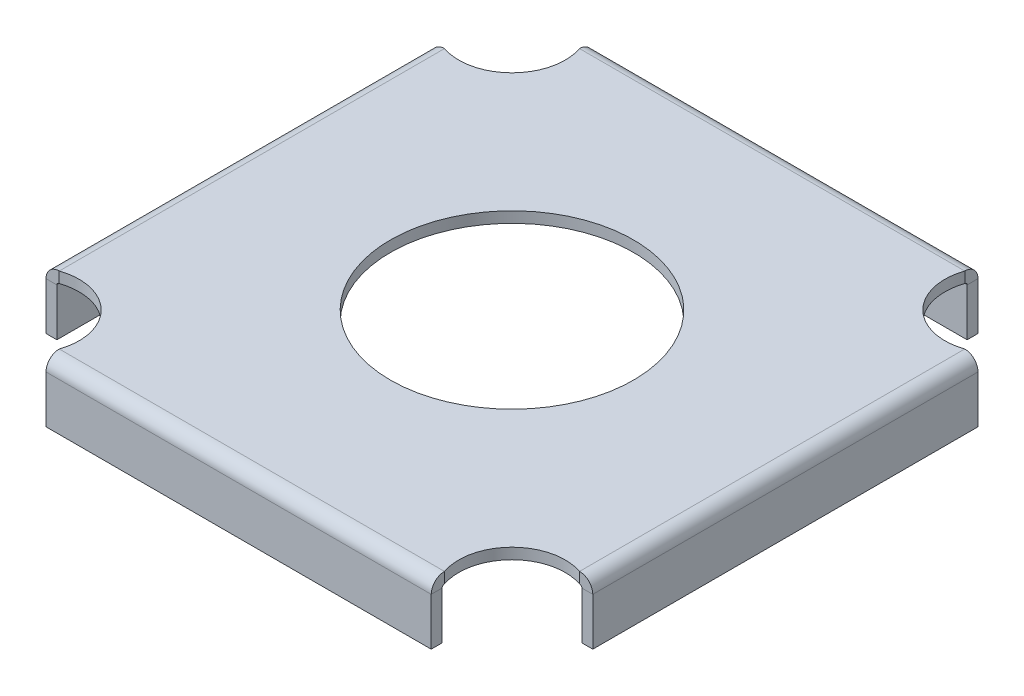
ISO-10303-21;
HEADER;
FILE_DESCRIPTION(('STEP AP214'),'2;1');
FILE_NAME('part.step','',(''),(''),'','','');
FILE_SCHEMA(('AUTOMOTIVE_DESIGN { 1 0 10303 214 1 1 1 1 }'));
ENDSEC;
DATA;
#1=APPLICATION_CONTEXT('core data for automotive mechanical design processes');
#2=APPLICATION_PROTOCOL_DEFINITION('international standard','automotive_design',2000,#1);
#3=PRODUCT_CONTEXT('',#1,'mechanical');
#4=PRODUCT('Part','Part','',(#3));
#5=PRODUCT_RELATED_PRODUCT_CATEGORY('part','',(#4));
#6=PRODUCT_DEFINITION_FORMATION('','',#4);
#7=PRODUCT_DEFINITION_CONTEXT('part definition',#1,'design');
#8=PRODUCT_DEFINITION('design','',#6,#7);
#9=PRODUCT_DEFINITION_SHAPE('','',#8);
#10=(LENGTH_UNIT() NAMED_UNIT(*) SI_UNIT(.MILLI.,.METRE.));
#11=(NAMED_UNIT(*) PLANE_ANGLE_UNIT() SI_UNIT($,.RADIAN.));
#12=(NAMED_UNIT(*) SI_UNIT($,.STERADIAN.) SOLID_ANGLE_UNIT());
#13=UNCERTAINTY_MEASURE_WITH_UNIT(LENGTH_MEASURE(1.E-05),#10,'distance_accuracy_value','');
#14=(GEOMETRIC_REPRESENTATION_CONTEXT(3) GLOBAL_UNCERTAINTY_ASSIGNED_CONTEXT((#13)) GLOBAL_UNIT_ASSIGNED_CONTEXT((#10,
#11,#12)) REPRESENTATION_CONTEXT('',''));
#15=CARTESIAN_POINT('',(0.,0.,0.));
#16=DIRECTION('',(0.,0.,1.));
#17=DIRECTION('',(1.,0.,0.));
#18=AXIS2_PLACEMENT_3D('',#15,#16,#17);
#19=CARTESIAN_POINT('',(76.2,-3.4163,76.2));
#20=DIRECTION('',(0.,1.,0.));
#21=DIRECTION('',(0.,0.,1.));
#22=AXIS2_PLACEMENT_3D('',#19,#20,#21);
#23=CYLINDRICAL_SURFACE('',#22,16.7005);
#24=CARTESIAN_POINT('',(76.2,0.,76.2));
#25=DIRECTION('',(0.,-1.,0.));
#26=DIRECTION('',(0.,0.,1.));
#27=AXIS2_PLACEMENT_3D('',#24,#25,#26);
#28=CIRCLE('',#27,16.7005);
#29=CARTESIAN_POINT('',(60.3828089759907,0.,81.5594));
#30=VERTEX_POINT('',#29);
#31=CARTESIAN_POINT('',(81.5594,0.,60.3828089759907));
#32=VERTEX_POINT('',#31);
#33=EDGE_CURVE('E464',#30,#32,#28,.T.);
#34=ORIENTED_EDGE('',*,*,#33,.F.);
#35=DIRECTION('',(0.,1.,0.));
#36=VECTOR('',#35,1.);
#37=CARTESIAN_POINT('',(60.3828089759907,-3.4163,81.5594));
#38=LINE('',#37,#36);
#39=CARTESIAN_POINT('',(60.3828089759907,-3.41629999999999,81.5594));
#40=VERTEX_POINT('',#39);
#41=EDGE_CURVE('E13',#40,#30,#38,.T.);
#42=ORIENTED_EDGE('',*,*,#41,.F.);
#43=CARTESIAN_POINT('',(76.2,-3.4163,76.2));
#44=DIRECTION('',(0.,-1.,0.));
#45=DIRECTION('',(0.,0.,1.));
#46=AXIS2_PLACEMENT_3D('',#43,#44,#45);
#47=CIRCLE('',#46,16.7005);
#48=CARTESIAN_POINT('',(81.5594,-3.4163,60.3828089759907));
#49=VERTEX_POINT('',#48);
#50=EDGE_CURVE('E467',#40,#49,#47,.T.);
#51=ORIENTED_EDGE('',*,*,#50,.T.);
#52=DIRECTION('',(0.,1.,0.));
#53=VECTOR('',#52,1.);
#54=CARTESIAN_POINT('',(81.5594,-3.4163,60.3828089759907));
#55=LINE('',#54,#53);
#56=EDGE_CURVE('E121',#49,#32,#55,.T.);
#57=ORIENTED_EDGE('',*,*,#56,.T.);
#58=EDGE_LOOP('',(#34,#42,#51,#57));
#59=FACE_BOUND('',#58,.T.);
#60=ADVANCED_FACE('F118',(#59),#23,.F.);
#61=CARTESIAN_POINT('',(-76.2,-3.4163,76.2));
#62=DIRECTION('',(0.,1.,0.));
#63=DIRECTION('',(0.,0.,1.));
#64=AXIS2_PLACEMENT_3D('',#61,#62,#63);
#65=CYLINDRICAL_SURFACE('',#64,16.7005);
#66=CARTESIAN_POINT('',(-76.2,0.,76.2));
#67=DIRECTION('',(0.,-1.,0.));
#68=DIRECTION('',(0.,0.,1.));
#69=AXIS2_PLACEMENT_3D('',#66,#67,#68);
#70=CIRCLE('',#69,16.7005);
#71=CARTESIAN_POINT('',(-81.5594,0.,60.3828089759907));
#72=VERTEX_POINT('',#71);
#73=CARTESIAN_POINT('',(-60.3828089759907,0.,81.5594));
#74=VERTEX_POINT('',#73);
#75=EDGE_CURVE('E505',#72,#74,#70,.T.);
#76=ORIENTED_EDGE('',*,*,#75,.F.);
#77=DIRECTION('',(0.,1.,0.));
#78=VECTOR('',#77,1.);
#79=CARTESIAN_POINT('',(-81.5594,-3.4163,60.3828089759907));
#80=LINE('',#79,#78);
#81=CARTESIAN_POINT('',(-81.5594,-3.4163,60.3828089759907));
#82=VERTEX_POINT('',#81);
#83=EDGE_CURVE('E512',#82,#72,#80,.T.);
#84=ORIENTED_EDGE('',*,*,#83,.F.);
#85=CARTESIAN_POINT('',(-76.2,-3.4163,76.2));
#86=DIRECTION('',(0.,-1.,0.));
#87=DIRECTION('',(0.,0.,1.));
#88=AXIS2_PLACEMENT_3D('',#85,#86,#87);
#89=CIRCLE('',#88,16.7005);
#90=CARTESIAN_POINT('',(-60.3828089759907,-3.41629999999999,81.5594));
#91=VERTEX_POINT('',#90);
#92=EDGE_CURVE('E483',#82,#91,#89,.T.);
#93=ORIENTED_EDGE('',*,*,#92,.T.);
#94=DIRECTION('',(0.,1.,0.));
#95=VECTOR('',#94,1.);
#96=CARTESIAN_POINT('',(-60.3828089759907,-3.4163,81.5594));
#97=LINE('',#96,#95);
#98=EDGE_CURVE('E126',#91,#74,#97,.T.);
#99=ORIENTED_EDGE('',*,*,#98,.T.);
#100=EDGE_LOOP('',(#76,#84,#93,#99));
#101=FACE_BOUND('',#100,.T.);
#102=ADVANCED_FACE('F544',(#101),#65,.F.);
#103=CARTESIAN_POINT('',(-76.2,-3.4163,-76.2));
#104=DIRECTION('',(0.,1.,0.));
#105=DIRECTION('',(0.,0.,1.));
#106=AXIS2_PLACEMENT_3D('',#103,#104,#105);
#107=CYLINDRICAL_SURFACE('',#106,16.7005);
#108=CARTESIAN_POINT('',(-76.2,0.,-76.2));
#109=DIRECTION('',(0.,-1.,0.));
#110=DIRECTION('',(0.,0.,1.));
#111=AXIS2_PLACEMENT_3D('',#108,#109,#110);
#112=CIRCLE('',#111,16.7005);
#113=CARTESIAN_POINT('',(-60.3828089759907,0.,-81.5594));
#114=VERTEX_POINT('',#113);
#115=CARTESIAN_POINT('',(-81.5594,0.,-60.3828089759907));
#116=VERTEX_POINT('',#115);
#117=EDGE_CURVE('E499',#114,#116,#112,.T.);
#118=ORIENTED_EDGE('',*,*,#117,.F.);
#119=DIRECTION('',(0.,1.,0.));
#120=VECTOR('',#119,1.);
#121=CARTESIAN_POINT('',(-60.3828089759907,-3.4163,-81.5594));
#122=LINE('',#121,#120);
#123=CARTESIAN_POINT('',(-60.3828089759907,-3.4163,-81.5594));
#124=VERTEX_POINT('',#123);
#125=EDGE_CURVE('E517',#124,#114,#122,.T.);
#126=ORIENTED_EDGE('',*,*,#125,.F.);
#127=CARTESIAN_POINT('',(-76.2,-3.4163,-76.2));
#128=DIRECTION('',(0.,-1.,0.));
#129=DIRECTION('',(0.,0.,1.));
#130=AXIS2_PLACEMENT_3D('',#127,#128,#129);
#131=CIRCLE('',#130,16.7005);
#132=CARTESIAN_POINT('',(-81.5594,-3.4163,-60.3828089759907));
#133=VERTEX_POINT('',#132);
#134=EDGE_CURVE('E478',#124,#133,#131,.T.);
#135=ORIENTED_EDGE('',*,*,#134,.T.);
#136=DIRECTION('',(0.,1.,0.));
#137=VECTOR('',#136,1.);
#138=CARTESIAN_POINT('',(-81.5594,-3.4163,-60.3828089759907));
#139=LINE('',#138,#137);
#140=EDGE_CURVE('E514',#133,#116,#139,.T.);
#141=ORIENTED_EDGE('',*,*,#140,.T.);
#142=EDGE_LOOP('',(#118,#126,#135,#141));
#143=FACE_BOUND('',#142,.T.);
#144=ADVANCED_FACE('F589',(#143),#107,.F.);
#145=CARTESIAN_POINT('',(76.2,-3.4163,-76.2));
#146=DIRECTION('',(0.,1.,0.));
#147=DIRECTION('',(0.,0.,1.));
#148=AXIS2_PLACEMENT_3D('',#145,#146,#147);
#149=CYLINDRICAL_SURFACE('',#148,16.7005);
#150=CARTESIAN_POINT('',(76.2,0.,-76.2));
#151=DIRECTION('',(0.,-1.,0.));
#152=DIRECTION('',(0.,0.,1.));
#153=AXIS2_PLACEMENT_3D('',#150,#151,#152);
#154=CIRCLE('',#153,16.7005);
#155=CARTESIAN_POINT('',(81.5594,0.,-60.3828089759907));
#156=VERTEX_POINT('',#155);
#157=CARTESIAN_POINT('',(60.3828089759907,0.,-81.5594));
#158=VERTEX_POINT('',#157);
#159=EDGE_CURVE('E493',#156,#158,#154,.T.);
#160=ORIENTED_EDGE('',*,*,#159,.F.);
#161=DIRECTION('',(0.,1.,0.));
#162=VECTOR('',#161,1.);
#163=CARTESIAN_POINT('',(81.5594,-3.4163,-60.3828089759907));
#164=LINE('',#163,#162);
#165=CARTESIAN_POINT('',(81.5594,-3.4163,-60.3828089759907));
#166=VERTEX_POINT('',#165);
#167=EDGE_CURVE('E522',#166,#156,#164,.T.);
#168=ORIENTED_EDGE('',*,*,#167,.F.);
#169=CARTESIAN_POINT('',(76.2,-3.4163,-76.2));
#170=DIRECTION('',(0.,-1.,0.));
#171=DIRECTION('',(0.,0.,1.));
#172=AXIS2_PLACEMENT_3D('',#169,#170,#171);
#173=CIRCLE('',#172,16.7005);
#174=CARTESIAN_POINT('',(60.3828089759907,-3.4163,-81.5594));
#175=VERTEX_POINT('',#174);
#176=EDGE_CURVE('E473',#166,#175,#173,.T.);
#177=ORIENTED_EDGE('',*,*,#176,.T.);
#178=DIRECTION('',(0.,1.,0.));
#179=VECTOR('',#178,1.);
#180=CARTESIAN_POINT('',(60.3828089759907,-3.4163,-81.5594));
#181=LINE('',#180,#179);
#182=EDGE_CURVE('E520',#175,#158,#181,.T.);
#183=ORIENTED_EDGE('',*,*,#182,.T.);
#184=EDGE_LOOP('',(#160,#168,#177,#183));
#185=FACE_BOUND('',#184,.T.);
#186=ADVANCED_FACE('F594',(#185),#149,.F.);
#187=CARTESIAN_POINT('',(76.2,-3.4163,76.2));
#188=DIRECTION('',(0.,1.,0.));
#189=DIRECTION('',(0.,0.,1.));
#190=AXIS2_PLACEMENT_3D('',#187,#188,#189);
#191=PLANE('',#190);
#192=CARTESIAN_POINT('',(0.,-3.4163,0.));
#193=DIRECTION('',(0.,1.,0.));
#194=DIRECTION('',(0.,0.,1.));
#195=AXIS2_PLACEMENT_3D('',#192,#193,#194);
#196=CIRCLE('',#195,38.1);
#197=CARTESIAN_POINT('',(0.,-3.4163,38.1));
#198=VERTEX_POINT('',#197);
#199=EDGE_CURVE('E461',#198,#198,#196,.T.);
#200=ORIENTED_EDGE('',*,*,#199,.T.);
#201=EDGE_LOOP('',(#200));
#202=FACE_BOUND('',#201,.T.);
#203=ORIENTED_EDGE('',*,*,#50,.F.);
#204=DIRECTION('',(1.,0.,0.));
#205=VECTOR('',#204,1.);
#206=CARTESIAN_POINT('',(60.3828089759907,-3.4163,81.5594));
#207=LINE('',#206,#205);
#208=EDGE_CURVE('E486',#91,#40,#207,.T.);
#209=ORIENTED_EDGE('',*,*,#208,.F.);
#210=ORIENTED_EDGE('',*,*,#92,.F.);
#211=DIRECTION('',(0.,0.,1.));
#212=VECTOR('',#211,1.);
#213=CARTESIAN_POINT('',(-81.5594,-3.4163,60.3828089759907));
#214=LINE('',#213,#212);
#215=EDGE_CURVE('E481',#133,#82,#214,.T.);
#216=ORIENTED_EDGE('',*,*,#215,.F.);
#217=ORIENTED_EDGE('',*,*,#134,.F.);
#218=DIRECTION('',(-1.,0.,0.));
#219=VECTOR('',#218,1.);
#220=CARTESIAN_POINT('',(-60.3828089759907,-3.4163,-81.5594));
#221=LINE('',#220,#219);
#222=EDGE_CURVE('E476',#175,#124,#221,.T.);
#223=ORIENTED_EDGE('',*,*,#222,.F.);
#224=ORIENTED_EDGE('',*,*,#176,.F.);
#225=DIRECTION('',(0.,0.,-1.));
#226=VECTOR('',#225,1.);
#227=CARTESIAN_POINT('',(81.5594,-3.4163,-60.3828089759907));
#228=LINE('',#227,#226);
#229=EDGE_CURVE('E470',#49,#166,#228,.T.);
#230=ORIENTED_EDGE('',*,*,#229,.F.);
#231=EDGE_LOOP('',(#203,#209,#210,#216,#217,#223,#224,#230));
#232=FACE_BOUND('',#231,.T.);
#233=ADVANCED_FACE('F550',(#202,#232),#191,.F.);
#234=CARTESIAN_POINT('',(76.2,0.,76.2));
#235=DIRECTION('',(0.,1.,0.));
#236=DIRECTION('',(0.,0.,1.));
#237=AXIS2_PLACEMENT_3D('',#234,#235,#236);
#238=PLANE('',#237);
#239=CARTESIAN_POINT('',(0.,0.,0.));
#240=DIRECTION('',(0.,1.,0.));
#241=DIRECTION('',(0.,0.,1.));
#242=AXIS2_PLACEMENT_3D('',#239,#240,#241);
#243=CIRCLE('',#242,38.1);
#244=CARTESIAN_POINT('',(0.,0.,38.1));
#245=VERTEX_POINT('',#244);
#246=EDGE_CURVE('E452',#245,#245,#243,.T.);
#247=ORIENTED_EDGE('',*,*,#246,.F.);
#248=EDGE_LOOP('',(#247));
#249=FACE_BOUND('',#248,.T.);
#250=ORIENTED_EDGE('',*,*,#33,.T.);
#251=DIRECTION('',(0.,0.,-1.));
#252=VECTOR('',#251,1.);
#253=CARTESIAN_POINT('',(81.5594,0.,-60.3828089759907));
#254=LINE('',#253,#252);
#255=EDGE_CURVE('E490',#32,#156,#254,.T.);
#256=ORIENTED_EDGE('',*,*,#255,.T.);
#257=ORIENTED_EDGE('',*,*,#159,.T.);
#258=DIRECTION('',(-1.,0.,0.));
#259=VECTOR('',#258,1.);
#260=CARTESIAN_POINT('',(-60.3828089759907,0.,-81.5594));
#261=LINE('',#260,#259);
#262=EDGE_CURVE('E496',#158,#114,#261,.T.);
#263=ORIENTED_EDGE('',*,*,#262,.T.);
#264=ORIENTED_EDGE('',*,*,#117,.T.);
#265=DIRECTION('',(0.,0.,1.));
#266=VECTOR('',#265,1.);
#267=CARTESIAN_POINT('',(-81.5594,0.,60.3828089759907));
#268=LINE('',#267,#266);
#269=EDGE_CURVE('E502',#116,#72,#268,.T.);
#270=ORIENTED_EDGE('',*,*,#269,.T.);
#271=ORIENTED_EDGE('',*,*,#75,.T.);
#272=DIRECTION('',(1.,0.,0.));
#273=VECTOR('',#272,1.);
#274=CARTESIAN_POINT('',(60.3828089759907,0.,81.5594));
#275=LINE('',#274,#273);
#276=EDGE_CURVE('E471',#74,#30,#275,.T.);
#277=ORIENTED_EDGE('',*,*,#276,.T.);
#278=EDGE_LOOP('',(#250,#256,#257,#263,#264,#270,#271,#277));
#279=FACE_BOUND('',#278,.T.);
#280=ADVANCED_FACE('F536',(#249,#279),#238,.T.);
#281=CARTESIAN_POINT('',(0.,-3.4163,0.));
#282=DIRECTION('',(0.,1.,0.));
#283=DIRECTION('',(0.,0.,1.));
#284=AXIS2_PLACEMENT_3D('',#281,#282,#283);
#285=CYLINDRICAL_SURFACE('',#284,38.1);
#286=ORIENTED_EDGE('',*,*,#199,.F.);
#287=EDGE_LOOP('',(#286));
#288=FACE_BOUND('',#287,.T.);
#289=ORIENTED_EDGE('',*,*,#246,.T.);
#290=EDGE_LOOP('',(#289));
#291=FACE_BOUND('',#290,.T.);
#292=ADVANCED_FACE('F708',(#288,#291),#285,.F.);
#293=CARTESIAN_POINT('',(60.3828089759907,-4.15289999999999,81.5594));
#294=DIRECTION('',(1.,0.,0.));
#295=DIRECTION('',(0.,0.,-1.));
#296=AXIS2_PLACEMENT_3D('',#293,#294,#295);
#297=PLANE('',#296);
#298=DIRECTION('',(0.,0.,1.));
#299=VECTOR('',#298,1.);
#300=CARTESIAN_POINT('',(60.3828089759907,-4.1529,85.7123));
#301=LINE('',#300,#299);
#302=CARTESIAN_POINT('',(60.3828089759907,-4.15289999999999,82.296));
#303=VERTEX_POINT('',#302);
#304=CARTESIAN_POINT('',(60.3828089759907,-4.15289999999998,85.7123));
#305=VERTEX_POINT('',#304);
#306=EDGE_CURVE('E410',#303,#305,#301,.T.);
#307=ORIENTED_EDGE('',*,*,#306,.F.);
#308=CARTESIAN_POINT('',(60.3828089759907,-4.15289999999999,81.5594));
#309=DIRECTION('',(-1.,0.,0.));
#310=DIRECTION('',(0.,0.,1.));
#311=AXIS2_PLACEMENT_3D('',#308,#309,#310);
#312=CIRCLE('',#311,0.736600000000004);
#313=EDGE_CURVE('E456',#40,#303,#312,.F.);
#314=ORIENTED_EDGE('',*,*,#313,.F.);
#315=ORIENTED_EDGE('',*,*,#41,.T.);
#316=CARTESIAN_POINT('',(60.3828089759907,-4.15289999999999,81.5594));
#317=DIRECTION('',(-1.,0.,0.));
#318=DIRECTION('',(0.,0.,1.));
#319=AXIS2_PLACEMENT_3D('',#316,#317,#318);
#320=CIRCLE('',#319,4.1529);
#321=EDGE_CURVE('E134',#30,#305,#320,.F.);
#322=ORIENTED_EDGE('',*,*,#321,.T.);
#323=EDGE_LOOP('',(#307,#314,#315,#322));
#324=FACE_BOUND('',#323,.T.);
#325=ADVANCED_FACE('F557',(#324),#297,.T.);
#326=CARTESIAN_POINT('',(-60.3828089759907,-4.15289999999999,81.5594));
#327=DIRECTION('',(1.,0.,0.));
#328=DIRECTION('',(0.,0.,-1.));
#329=AXIS2_PLACEMENT_3D('',#326,#327,#328);
#330=PLANE('',#329);
#331=CARTESIAN_POINT('',(-60.3828089759907,-4.15289999999999,81.5594));
#332=DIRECTION('',(-1.,0.,0.));
#333=DIRECTION('',(0.,0.,1.));
#334=AXIS2_PLACEMENT_3D('',#331,#332,#333);
#335=CIRCLE('',#334,0.736600000000004);
#336=CARTESIAN_POINT('',(-60.3828089759907,-4.15289999999999,82.296));
#337=VERTEX_POINT('',#336);
#338=EDGE_CURVE('E421',#337,#91,#335,.T.);
#339=ORIENTED_EDGE('',*,*,#338,.F.);
#340=DIRECTION('',(0.,0.,1.));
#341=VECTOR('',#340,1.);
#342=CARTESIAN_POINT('',(-60.3828089759907,-4.15289999999999,82.296));
#343=LINE('',#342,#341);
#344=CARTESIAN_POINT('',(-60.3828089759907,-4.15289999999999,85.7123));
#345=VERTEX_POINT('',#344);
#346=EDGE_CURVE('E444',#337,#345,#343,.T.);
#347=ORIENTED_EDGE('',*,*,#346,.T.);
#348=CARTESIAN_POINT('',(-60.3828089759907,-4.15289999999999,81.5594));
#349=DIRECTION('',(-1.,0.,0.));
#350=DIRECTION('',(0.,0.,1.));
#351=AXIS2_PLACEMENT_3D('',#348,#349,#350);
#352=CIRCLE('',#351,4.1529);
#353=EDGE_CURVE('E453',#345,#74,#352,.T.);
#354=ORIENTED_EDGE('',*,*,#353,.T.);
#355=ORIENTED_EDGE('',*,*,#98,.F.);
#356=EDGE_LOOP('',(#339,#347,#354,#355));
#357=FACE_BOUND('',#356,.T.);
#358=ADVANCED_FACE('F541',(#357),#330,.F.);
#359=CARTESIAN_POINT('',(-60.3828089759907,-4.15289999999999,81.5594));
#360=DIRECTION('',(-1.,0.,0.));
#361=DIRECTION('',(0.,0.,1.));
#362=AXIS2_PLACEMENT_3D('',#359,#360,#361);
#363=CYLINDRICAL_SURFACE('',#362,4.1529);
#364=ORIENTED_EDGE('',*,*,#276,.F.);
#365=ORIENTED_EDGE('',*,*,#353,.F.);
#366=DIRECTION('',(-1.,0.,0.));
#367=VECTOR('',#366,1.);
#368=CARTESIAN_POINT('',(0.,-4.15289999999999,85.7123));
#369=LINE('',#368,#367);
#370=EDGE_CURVE('E441',#305,#345,#369,.T.);
#371=ORIENTED_EDGE('',*,*,#370,.F.);
#372=ORIENTED_EDGE('',*,*,#321,.F.);
#373=EDGE_LOOP('',(#364,#365,#371,#372));
#374=FACE_BOUND('',#373,.T.);
#375=ADVANCED_FACE('F538',(#374),#363,.T.);
#376=CARTESIAN_POINT('',(-60.3828089759907,-4.15289999999999,81.5594));
#377=DIRECTION('',(-1.,0.,0.));
#378=DIRECTION('',(0.,0.,1.));
#379=AXIS2_PLACEMENT_3D('',#376,#377,#378);
#380=CYLINDRICAL_SURFACE('',#379,0.736600000000004);
#381=ORIENTED_EDGE('',*,*,#208,.T.);
#382=ORIENTED_EDGE('',*,*,#313,.T.);
#383=DIRECTION('',(1.,0.,0.));
#384=VECTOR('',#383,1.);
#385=CARTESIAN_POINT('',(60.3828089759907,-4.1529,82.296));
#386=LINE('',#385,#384);
#387=EDGE_CURVE('E447',#303,#337,#386,.F.);
#388=ORIENTED_EDGE('',*,*,#387,.T.);
#389=ORIENTED_EDGE('',*,*,#338,.T.);
#390=EDGE_LOOP('',(#381,#382,#388,#389));
#391=FACE_BOUND('',#390,.T.);
#392=ADVANCED_FACE('F554',(#391),#380,.F.);
#393=CARTESIAN_POINT('',(-60.3828089759907,-3.41629999999999,85.7123));
#394=DIRECTION('',(-1.,0.,0.));
#395=DIRECTION('',(0.,0.,1.));
#396=AXIS2_PLACEMENT_3D('',#393,#394,#395);
#397=PLANE('',#396);
#398=DIRECTION('',(0.,1.,0.));
#399=VECTOR('',#398,1.);
#400=CARTESIAN_POINT('',(-60.3828089759907,-3.41629999999999,85.7123));
#401=LINE('',#400,#399);
#402=CARTESIAN_POINT('',(-60.3828089759907,-19.05,85.7123));
#403=VERTEX_POINT('',#402);
#404=EDGE_CURVE('E425',#403,#345,#401,.T.);
#405=ORIENTED_EDGE('',*,*,#404,.T.);
#406=ORIENTED_EDGE('',*,*,#346,.F.);
#407=DIRECTION('',(0.,-1.,0.));
#408=VECTOR('',#407,1.);
#409=CARTESIAN_POINT('',(-60.3828089759907,2.17196961742773E-13,82.296));
#410=LINE('',#409,#408);
#411=CARTESIAN_POINT('',(-60.3828089759907,-19.05,82.296));
#412=VERTEX_POINT('',#411);
#413=EDGE_CURVE('E433',#412,#337,#410,.F.);
#414=ORIENTED_EDGE('',*,*,#413,.F.);
#415=DIRECTION('',(0.,0.,-1.));
#416=VECTOR('',#415,1.);
#417=CARTESIAN_POINT('',(-60.3828089759907,-19.05,85.7123));
#418=LINE('',#417,#416);
#419=EDGE_CURVE('E419',#403,#412,#418,.T.);
#420=ORIENTED_EDGE('',*,*,#419,.F.);
#421=EDGE_LOOP('',(#405,#406,#414,#420));
#422=FACE_BOUND('',#421,.T.);
#423=ADVANCED_FACE('F574',(#422),#397,.T.);
#424=CARTESIAN_POINT('',(60.3828089759907,-19.05,85.7123));
#425=DIRECTION('',(1.,0.,0.));
#426=DIRECTION('',(0.,0.,-1.));
#427=AXIS2_PLACEMENT_3D('',#424,#425,#426);
#428=PLANE('',#427);
#429=DIRECTION('',(0.,1.,0.));
#430=VECTOR('',#429,1.);
#431=CARTESIAN_POINT('',(60.3828089759907,2.17196961742773E-13,82.296));
#432=LINE('',#431,#430);
#433=CARTESIAN_POINT('',(60.3828089759907,-19.05,82.296));
#434=VERTEX_POINT('',#433);
#435=EDGE_CURVE('E439',#303,#434,#432,.F.);
#436=ORIENTED_EDGE('',*,*,#435,.F.);
#437=ORIENTED_EDGE('',*,*,#306,.T.);
#438=DIRECTION('',(0.,-1.,0.));
#439=VECTOR('',#438,1.);
#440=CARTESIAN_POINT('',(60.3828089759907,-19.05,85.7123));
#441=LINE('',#440,#439);
#442=CARTESIAN_POINT('',(60.3828089759907,-19.05,85.7123));
#443=VERTEX_POINT('',#442);
#444=EDGE_CURVE('E431',#305,#443,#441,.T.);
#445=ORIENTED_EDGE('',*,*,#444,.T.);
#446=DIRECTION('',(0.,0.,-1.));
#447=VECTOR('',#446,1.);
#448=CARTESIAN_POINT('',(60.3828089759907,-19.05,85.7123));
#449=LINE('',#448,#447);
#450=EDGE_CURVE('E422',#443,#434,#449,.T.);
#451=ORIENTED_EDGE('',*,*,#450,.T.);
#452=EDGE_LOOP('',(#436,#437,#445,#451));
#453=FACE_BOUND('',#452,.T.);
#454=ADVANCED_FACE('F561',(#453),#428,.T.);
#455=CARTESIAN_POINT('',(0.,2.29124909440662E-13,85.7123));
#456=DIRECTION('',(0.,0.,1.));
#457=DIRECTION('',(0.,-1.,0.));
#458=AXIS2_PLACEMENT_3D('',#455,#456,#457);
#459=PLANE('',#458);
#460=ORIENTED_EDGE('',*,*,#444,.F.);
#461=ORIENTED_EDGE('',*,*,#370,.T.);
#462=ORIENTED_EDGE('',*,*,#404,.F.);
#463=DIRECTION('',(-1.,0.,0.));
#464=VECTOR('',#463,1.);
#465=CARTESIAN_POINT('',(-60.3828089759907,-19.05,85.7123));
#466=LINE('',#465,#464);
#467=EDGE_CURVE('E428',#443,#403,#466,.T.);
#468=ORIENTED_EDGE('',*,*,#467,.F.);
#469=EDGE_LOOP('',(#460,#461,#462,#468));
#470=FACE_BOUND('',#469,.T.);
#471=ADVANCED_FACE('F565',(#470),#459,.T.);
#472=CARTESIAN_POINT('',(0.,2.17196961742773E-13,82.296));
#473=DIRECTION('',(0.,0.,1.));
#474=DIRECTION('',(0.,-1.,0.));
#475=AXIS2_PLACEMENT_3D('',#472,#473,#474);
#476=PLANE('',#475);
#477=ORIENTED_EDGE('',*,*,#387,.F.);
#478=ORIENTED_EDGE('',*,*,#435,.T.);
#479=DIRECTION('',(1.,0.,0.));
#480=VECTOR('',#479,1.);
#481=CARTESIAN_POINT('',(0.,-19.05,82.296));
#482=LINE('',#481,#480);
#483=EDGE_CURVE('E436',#434,#412,#482,.F.);
#484=ORIENTED_EDGE('',*,*,#483,.T.);
#485=ORIENTED_EDGE('',*,*,#413,.T.);
#486=EDGE_LOOP('',(#477,#478,#484,#485));
#487=FACE_BOUND('',#486,.T.);
#488=ADVANCED_FACE('F572',(#487),#476,.F.);
#489=CARTESIAN_POINT('',(-60.3828089759907,-19.05,85.7123));
#490=DIRECTION('',(0.,-1.,0.));
#491=DIRECTION('',(0.,0.,-1.));
#492=AXIS2_PLACEMENT_3D('',#489,#490,#491);
#493=PLANE('',#492);
#494=ORIENTED_EDGE('',*,*,#483,.F.);
#495=ORIENTED_EDGE('',*,*,#450,.F.);
#496=ORIENTED_EDGE('',*,*,#467,.T.);
#497=ORIENTED_EDGE('',*,*,#419,.T.);
#498=EDGE_LOOP('',(#494,#495,#496,#497));
#499=FACE_BOUND('',#498,.T.);
#500=ADVANCED_FACE('F569',(#499),#493,.T.);
#501=CARTESIAN_POINT('',(81.5594,-4.1529,-60.3828089759907));
#502=DIRECTION('',(0.,0.,-1.));
#503=DIRECTION('',(-1.,0.,0.));
#504=AXIS2_PLACEMENT_3D('',#501,#502,#503);
#505=PLANE('',#504);
#506=DIRECTION('',(1.,0.,0.));
#507=VECTOR('',#506,1.);
#508=CARTESIAN_POINT('',(85.7123,-4.15289999999999,-60.3828089759907));
#509=LINE('',#508,#507);
#510=CARTESIAN_POINT('',(82.296,-4.1529,-60.3828089759907));
#511=VERTEX_POINT('',#510);
#512=CARTESIAN_POINT('',(85.7123,-4.15289999999999,-60.3828089759907));
#513=VERTEX_POINT('',#512);
#514=EDGE_CURVE('E367',#511,#513,#509,.T.);
#515=ORIENTED_EDGE('',*,*,#514,.F.);
#516=CARTESIAN_POINT('',(81.5594,-4.1529,-60.3828089759907));
#517=DIRECTION('',(0.,0.,1.));
#518=DIRECTION('',(1.,0.,0.));
#519=AXIS2_PLACEMENT_3D('',#516,#517,#518);
#520=CIRCLE('',#519,0.736600000000004);
#521=EDGE_CURVE('E414',#166,#511,#520,.F.);
#522=ORIENTED_EDGE('',*,*,#521,.F.);
#523=ORIENTED_EDGE('',*,*,#167,.T.);
#524=CARTESIAN_POINT('',(81.5594,-4.1529,-60.3828089759907));
#525=DIRECTION('',(0.,0.,1.));
#526=DIRECTION('',(1.,0.,0.));
#527=AXIS2_PLACEMENT_3D('',#524,#525,#526);
#528=CIRCLE('',#527,4.1529);
#529=EDGE_CURVE('E407',#156,#513,#528,.F.);
#530=ORIENTED_EDGE('',*,*,#529,.T.);
#531=EDGE_LOOP('',(#515,#522,#523,#530));
#532=FACE_BOUND('',#531,.T.);
#533=ADVANCED_FACE('F691',(#532),#505,.T.);
#534=CARTESIAN_POINT('',(81.5594,-4.1529,60.3828089759907));
#535=DIRECTION('',(0.,0.,-1.));
#536=DIRECTION('',(-1.,0.,0.));
#537=AXIS2_PLACEMENT_3D('',#534,#535,#536);
#538=PLANE('',#537);
#539=CARTESIAN_POINT('',(81.5594,-4.1529,60.3828089759907));
#540=DIRECTION('',(0.,0.,1.));
#541=DIRECTION('',(1.,0.,0.));
#542=AXIS2_PLACEMENT_3D('',#539,#540,#541);
#543=CIRCLE('',#542,0.736600000000004);
#544=CARTESIAN_POINT('',(82.296,-4.1529,60.3828089759907));
#545=VERTEX_POINT('',#544);
#546=EDGE_CURVE('E378',#545,#49,#543,.T.);
#547=ORIENTED_EDGE('',*,*,#546,.F.);
#548=DIRECTION('',(1.,0.,0.));
#549=VECTOR('',#548,1.);
#550=CARTESIAN_POINT('',(82.296,-4.1529,60.3828089759907));
#551=LINE('',#550,#549);
#552=CARTESIAN_POINT('',(85.7123,-4.15289999999999,60.3828089759907));
#553=VERTEX_POINT('',#552);
#554=EDGE_CURVE('E400',#545,#553,#551,.T.);
#555=ORIENTED_EDGE('',*,*,#554,.T.);
#556=CARTESIAN_POINT('',(81.5594,-4.1529,60.3828089759907));
#557=DIRECTION('',(0.,0.,1.));
#558=DIRECTION('',(1.,0.,0.));
#559=AXIS2_PLACEMENT_3D('',#556,#557,#558);
#560=CIRCLE('',#559,4.1529);
#561=EDGE_CURVE('E411',#553,#32,#560,.T.);
#562=ORIENTED_EDGE('',*,*,#561,.T.);
#563=ORIENTED_EDGE('',*,*,#56,.F.);
#564=EDGE_LOOP('',(#547,#555,#562,#563));
#565=FACE_BOUND('',#564,.T.);
#566=ADVANCED_FACE('F686',(#565),#538,.F.);
#567=CARTESIAN_POINT('',(81.5594,-4.1529,60.3828089759907));
#568=DIRECTION('',(0.,0.,1.));
#569=DIRECTION('',(1.,0.,0.));
#570=AXIS2_PLACEMENT_3D('',#567,#568,#569);
#571=CYLINDRICAL_SURFACE('',#570,4.1529);
#572=ORIENTED_EDGE('',*,*,#255,.F.);
#573=ORIENTED_EDGE('',*,*,#561,.F.);
#574=DIRECTION('',(0.,0.,1.));
#575=VECTOR('',#574,1.);
#576=CARTESIAN_POINT('',(85.7123,-4.15289999999999,-60.3828089759907));
#577=LINE('',#576,#575);
#578=EDGE_CURVE('E398',#553,#513,#577,.F.);
#579=ORIENTED_EDGE('',*,*,#578,.T.);
#580=ORIENTED_EDGE('',*,*,#529,.F.);
#581=EDGE_LOOP('',(#572,#573,#579,#580));
#582=FACE_BOUND('',#581,.T.);
#583=ADVANCED_FACE('F683',(#582),#571,.T.);
#584=CARTESIAN_POINT('',(81.5594,-4.1529,60.3828089759907));
#585=DIRECTION('',(0.,0.,1.));
#586=DIRECTION('',(1.,0.,0.));
#587=AXIS2_PLACEMENT_3D('',#584,#585,#586);
#588=CYLINDRICAL_SURFACE('',#587,0.736600000000004);
#589=ORIENTED_EDGE('',*,*,#229,.T.);
#590=ORIENTED_EDGE('',*,*,#521,.T.);
#591=DIRECTION('',(0.,0.,1.));
#592=VECTOR('',#591,1.);
#593=CARTESIAN_POINT('',(82.296,-4.1529,-60.3828089759907));
#594=LINE('',#593,#592);
#595=EDGE_CURVE('E403',#511,#545,#594,.T.);
#596=ORIENTED_EDGE('',*,*,#595,.T.);
#597=ORIENTED_EDGE('',*,*,#546,.T.);
#598=EDGE_LOOP('',(#589,#590,#596,#597));
#599=FACE_BOUND('',#598,.T.);
#600=ADVANCED_FACE('F681',(#599),#588,.F.);
#601=CARTESIAN_POINT('',(85.7123,-3.41629999999999,-60.3828089759907));
#602=DIRECTION('',(0.,0.,-1.));
#603=DIRECTION('',(-1.,0.,0.));
#604=AXIS2_PLACEMENT_3D('',#601,#602,#603);
#605=PLANE('',#604);
#606=DIRECTION('',(0.,-1.,0.));
#607=VECTOR('',#606,1.);
#608=CARTESIAN_POINT('',(82.296,2.89595948990363E-13,-60.3828089759907));
#609=LINE('',#608,#607);
#610=CARTESIAN_POINT('',(82.2960000000001,-19.05,-60.3828089759907));
#611=VERTEX_POINT('',#610);
#612=EDGE_CURVE('E396',#511,#611,#609,.T.);
#613=ORIENTED_EDGE('',*,*,#612,.F.);
#614=ORIENTED_EDGE('',*,*,#514,.T.);
#615=DIRECTION('',(0.,1.,0.));
#616=VECTOR('',#615,1.);
#617=CARTESIAN_POINT('',(85.7123,-3.41629999999999,-60.3828089759907));
#618=LINE('',#617,#616);
#619=CARTESIAN_POINT('',(85.7123000000001,-19.05,-60.3828089759907));
#620=VERTEX_POINT('',#619);
#621=EDGE_CURVE('E388',#513,#620,#618,.F.);
#622=ORIENTED_EDGE('',*,*,#621,.T.);
#623=DIRECTION('',(-1.,0.,0.));
#624=VECTOR('',#623,1.);
#625=CARTESIAN_POINT('',(85.7123000000001,-19.05,-60.3828089759907));
#626=LINE('',#625,#624);
#627=EDGE_CURVE('E379',#620,#611,#626,.T.);
#628=ORIENTED_EDGE('',*,*,#627,.T.);
#629=EDGE_LOOP('',(#613,#614,#622,#628));
#630=FACE_BOUND('',#629,.T.);
#631=ADVANCED_FACE('F674',(#630),#605,.T.);
#632=CARTESIAN_POINT('',(85.7123000000001,-19.05,60.3828089759907));
#633=DIRECTION('',(0.,0.,1.));
#634=DIRECTION('',(0.,-1.,0.));
#635=AXIS2_PLACEMENT_3D('',#632,#633,#634);
#636=PLANE('',#635);
#637=DIRECTION('',(0.,-1.,0.));
#638=VECTOR('',#637,1.);
#639=CARTESIAN_POINT('',(85.7123000000001,-19.05,60.3828089759907));
#640=LINE('',#639,#638);
#641=CARTESIAN_POINT('',(85.7123000000001,-19.05,60.3828089759907));
#642=VERTEX_POINT('',#641);
#643=EDGE_CURVE('E382',#642,#553,#640,.F.);
#644=ORIENTED_EDGE('',*,*,#643,.T.);
#645=ORIENTED_EDGE('',*,*,#554,.F.);
#646=DIRECTION('',(0.,1.,0.));
#647=VECTOR('',#646,1.);
#648=CARTESIAN_POINT('',(82.296,3.16396380436809E-13,60.3828089759907));
#649=LINE('',#648,#647);
#650=CARTESIAN_POINT('',(82.2960000000001,-19.05,60.3828089759907));
#651=VERTEX_POINT('',#650);
#652=EDGE_CURVE('E390',#651,#545,#649,.T.);
#653=ORIENTED_EDGE('',*,*,#652,.F.);
#654=DIRECTION('',(-1.,0.,0.));
#655=VECTOR('',#654,1.);
#656=CARTESIAN_POINT('',(85.7123000000001,-19.05,60.3828089759907));
#657=LINE('',#656,#655);
#658=EDGE_CURVE('E376',#642,#651,#657,.T.);
#659=ORIENTED_EDGE('',*,*,#658,.F.);
#660=EDGE_LOOP('',(#644,#645,#653,#659));
#661=FACE_BOUND('',#660,.T.);
#662=ADVANCED_FACE('F667',(#661),#636,.T.);
#663=CARTESIAN_POINT('',(85.7123,3.01523896688253E-13,0.));
#664=DIRECTION('',(-1.,0.,0.));
#665=DIRECTION('',(0.,-1.,0.));
#666=AXIS2_PLACEMENT_3D('',#663,#664,#665);
#667=PLANE('',#666);
#668=ORIENTED_EDGE('',*,*,#578,.F.);
#669=ORIENTED_EDGE('',*,*,#643,.F.);
#670=DIRECTION('',(0.,0.,-1.));
#671=VECTOR('',#670,1.);
#672=CARTESIAN_POINT('',(85.7123000000001,-19.05,-60.3828089759907));
#673=LINE('',#672,#671);
#674=EDGE_CURVE('E385',#620,#642,#673,.F.);
#675=ORIENTED_EDGE('',*,*,#674,.F.);
#676=ORIENTED_EDGE('',*,*,#621,.F.);
#677=EDGE_LOOP('',(#668,#669,#675,#676));
#678=FACE_BOUND('',#677,.T.);
#679=ADVANCED_FACE('F663',(#678),#667,.F.);
#680=CARTESIAN_POINT('',(82.296,2.89595948990363E-13,0.));
#681=DIRECTION('',(-1.,0.,0.));
#682=DIRECTION('',(0.,-1.,0.));
#683=AXIS2_PLACEMENT_3D('',#680,#681,#682);
#684=PLANE('',#683);
#685=ORIENTED_EDGE('',*,*,#652,.T.);
#686=ORIENTED_EDGE('',*,*,#595,.F.);
#687=ORIENTED_EDGE('',*,*,#612,.T.);
#688=DIRECTION('',(0.,0.,1.));
#689=VECTOR('',#688,1.);
#690=CARTESIAN_POINT('',(82.2960000000001,-19.05,0.));
#691=LINE('',#690,#689);
#692=EDGE_CURVE('E393',#611,#651,#691,.T.);
#693=ORIENTED_EDGE('',*,*,#692,.T.);
#694=EDGE_LOOP('',(#685,#686,#687,#693));
#695=FACE_BOUND('',#694,.T.);
#696=ADVANCED_FACE('F666',(#695),#684,.T.);
#697=CARTESIAN_POINT('',(85.7123000000001,-19.05,-60.3828089759907));
#698=DIRECTION('',(0.,-1.,0.));
#699=DIRECTION('',(1.,0.,0.));
#700=AXIS2_PLACEMENT_3D('',#697,#698,#699);
#701=PLANE('',#700);
#702=ORIENTED_EDGE('',*,*,#692,.F.);
#703=ORIENTED_EDGE('',*,*,#627,.F.);
#704=ORIENTED_EDGE('',*,*,#674,.T.);
#705=ORIENTED_EDGE('',*,*,#658,.T.);
#706=EDGE_LOOP('',(#702,#703,#704,#705));
#707=FACE_BOUND('',#706,.T.);
#708=ADVANCED_FACE('F660',(#707),#701,.T.);
#709=CARTESIAN_POINT('',(-60.3828089759907,-4.1529,-81.5594));
#710=DIRECTION('',(-1.,0.,0.));
#711=DIRECTION('',(0.,0.,1.));
#712=AXIS2_PLACEMENT_3D('',#709,#710,#711);
#713=PLANE('',#712);
#714=DIRECTION('',(0.,0.,-1.));
#715=VECTOR('',#714,1.);
#716=CARTESIAN_POINT('',(-60.3828089759907,-4.15289999999998,-85.7123));
#717=LINE('',#716,#715);
#718=CARTESIAN_POINT('',(-60.3828089759907,-4.1529,-82.296));
#719=VERTEX_POINT('',#718);
#720=CARTESIAN_POINT('',(-60.3828089759907,-4.15289999999998,-85.7123));
#721=VERTEX_POINT('',#720);
#722=EDGE_CURVE('E324',#719,#721,#717,.T.);
#723=ORIENTED_EDGE('',*,*,#722,.F.);
#724=CARTESIAN_POINT('',(-60.3828089759907,-4.1529,-81.5594));
#725=DIRECTION('',(1.,0.,0.));
#726=DIRECTION('',(0.,0.,-1.));
#727=AXIS2_PLACEMENT_3D('',#724,#725,#726);
#728=CIRCLE('',#727,0.736600000000004);
#729=EDGE_CURVE('E371',#124,#719,#728,.F.);
#730=ORIENTED_EDGE('',*,*,#729,.F.);
#731=ORIENTED_EDGE('',*,*,#125,.T.);
#732=CARTESIAN_POINT('',(-60.3828089759907,-4.1529,-81.5594));
#733=DIRECTION('',(1.,0.,0.));
#734=DIRECTION('',(0.,0.,-1.));
#735=AXIS2_PLACEMENT_3D('',#732,#733,#734);
#736=CIRCLE('',#735,4.1529);
#737=EDGE_CURVE('E364',#114,#721,#736,.F.);
#738=ORIENTED_EDGE('',*,*,#737,.T.);
#739=EDGE_LOOP('',(#723,#730,#731,#738));
#740=FACE_BOUND('',#739,.T.);
#741=ADVANCED_FACE('F631',(#740),#713,.T.);
#742=CARTESIAN_POINT('',(60.3828089759907,-4.1529,-81.5594));
#743=DIRECTION('',(-1.,0.,0.));
#744=DIRECTION('',(0.,0.,1.));
#745=AXIS2_PLACEMENT_3D('',#742,#743,#744);
#746=PLANE('',#745);
#747=CARTESIAN_POINT('',(60.3828089759907,-4.1529,-81.5594));
#748=DIRECTION('',(1.,0.,0.));
#749=DIRECTION('',(0.,0.,-1.));
#750=AXIS2_PLACEMENT_3D('',#747,#748,#749);
#751=CIRCLE('',#750,0.736600000000004);
#752=CARTESIAN_POINT('',(60.3828089759907,-4.1529,-82.296));
#753=VERTEX_POINT('',#752);
#754=EDGE_CURVE('E335',#753,#175,#751,.T.);
#755=ORIENTED_EDGE('',*,*,#754,.F.);
#756=DIRECTION('',(0.,0.,-1.));
#757=VECTOR('',#756,1.);
#758=CARTESIAN_POINT('',(60.3828089759907,-4.15289999999999,-82.296));
#759=LINE('',#758,#757);
#760=CARTESIAN_POINT('',(60.3828089759907,-4.15289999999996,-85.7123));
#761=VERTEX_POINT('',#760);
#762=EDGE_CURVE('E357',#753,#761,#759,.T.);
#763=ORIENTED_EDGE('',*,*,#762,.T.);
#764=CARTESIAN_POINT('',(60.3828089759907,-4.1529,-81.5594));
#765=DIRECTION('',(1.,0.,0.));
#766=DIRECTION('',(0.,0.,-1.));
#767=AXIS2_PLACEMENT_3D('',#764,#765,#766);
#768=CIRCLE('',#767,4.1529);
#769=EDGE_CURVE('E368',#761,#158,#768,.T.);
#770=ORIENTED_EDGE('',*,*,#769,.T.);
#771=ORIENTED_EDGE('',*,*,#182,.F.);
#772=EDGE_LOOP('',(#755,#763,#770,#771));
#773=FACE_BOUND('',#772,.T.);
#774=ADVANCED_FACE('F611',(#773),#746,.F.);
#775=CARTESIAN_POINT('',(60.3828089759907,-4.1529,-81.5594));
#776=DIRECTION('',(1.,0.,0.));
#777=DIRECTION('',(0.,0.,-1.));
#778=AXIS2_PLACEMENT_3D('',#775,#776,#777);
#779=CYLINDRICAL_SURFACE('',#778,4.1529);
#780=ORIENTED_EDGE('',*,*,#262,.F.);
#781=ORIENTED_EDGE('',*,*,#769,.F.);
#782=DIRECTION('',(1.,0.,0.));
#783=VECTOR('',#782,1.);
#784=CARTESIAN_POINT('',(-60.3828089759907,-4.15289999999998,-85.7123));
#785=LINE('',#784,#783);
#786=EDGE_CURVE('E355',#761,#721,#785,.F.);
#787=ORIENTED_EDGE('',*,*,#786,.T.);
#788=ORIENTED_EDGE('',*,*,#737,.F.);
#789=EDGE_LOOP('',(#780,#781,#787,#788));
#790=FACE_BOUND('',#789,.T.);
#791=ADVANCED_FACE('F608',(#790),#779,.T.);
#792=CARTESIAN_POINT('',(60.3828089759907,-4.1529,-81.5594));
#793=DIRECTION('',(1.,0.,0.));
#794=DIRECTION('',(0.,0.,-1.));
#795=AXIS2_PLACEMENT_3D('',#792,#793,#794);
#796=CYLINDRICAL_SURFACE('',#795,0.736600000000004);
#797=ORIENTED_EDGE('',*,*,#222,.T.);
#798=ORIENTED_EDGE('',*,*,#729,.T.);
#799=DIRECTION('',(1.,0.,0.));
#800=VECTOR('',#799,1.);
#801=CARTESIAN_POINT('',(-60.3828089759907,-4.1529,-82.296));
#802=LINE('',#801,#800);
#803=EDGE_CURVE('E360',#719,#753,#802,.T.);
#804=ORIENTED_EDGE('',*,*,#803,.T.);
#805=ORIENTED_EDGE('',*,*,#754,.T.);
#806=EDGE_LOOP('',(#797,#798,#804,#805));
#807=FACE_BOUND('',#806,.T.);
#808=ADVANCED_FACE('F635',(#807),#796,.F.);
#809=CARTESIAN_POINT('',(-60.3828089759907,-3.41629999999999,-85.7123));
#810=DIRECTION('',(-1.,0.,0.));
#811=DIRECTION('',(0.,0.,1.));
#812=AXIS2_PLACEMENT_3D('',#809,#810,#811);
#813=PLANE('',#812);
#814=DIRECTION('',(0.,-1.,0.));
#815=VECTOR('',#814,1.);
#816=CARTESIAN_POINT('',(-60.3828089759907,2.89595948990363E-13,-82.296));
#817=LINE('',#816,#815);
#818=CARTESIAN_POINT('',(-60.3828089759907,-19.05,-82.296));
#819=VERTEX_POINT('',#818);
#820=EDGE_CURVE('E353',#719,#819,#817,.T.);
#821=ORIENTED_EDGE('',*,*,#820,.F.);
#822=ORIENTED_EDGE('',*,*,#722,.T.);
#823=DIRECTION('',(0.,1.,0.));
#824=VECTOR('',#823,1.);
#825=CARTESIAN_POINT('',(-60.3828089759907,-3.41629999999999,-85.7123));
#826=LINE('',#825,#824);
#827=CARTESIAN_POINT('',(-60.3828089759907,-19.05,-85.7123));
#828=VERTEX_POINT('',#827);
#829=EDGE_CURVE('E345',#721,#828,#826,.F.);
#830=ORIENTED_EDGE('',*,*,#829,.T.);
#831=DIRECTION('',(0.,0.,1.));
#832=VECTOR('',#831,1.);
#833=CARTESIAN_POINT('',(-60.3828089759907,-19.05,-85.7123));
#834=LINE('',#833,#832);
#835=EDGE_CURVE('E336',#828,#819,#834,.T.);
#836=ORIENTED_EDGE('',*,*,#835,.T.);
#837=EDGE_LOOP('',(#821,#822,#830,#836));
#838=FACE_BOUND('',#837,.T.);
#839=ADVANCED_FACE('F628',(#838),#813,.T.);
#840=CARTESIAN_POINT('',(60.3828089759907,-19.05,-85.7123));
#841=DIRECTION('',(1.,0.,0.));
#842=DIRECTION('',(0.,1.,0.));
#843=AXIS2_PLACEMENT_3D('',#840,#841,#842);
#844=PLANE('',#843);
#845=DIRECTION('',(0.,-1.,0.));
#846=VECTOR('',#845,1.);
#847=CARTESIAN_POINT('',(60.3828089759907,-19.05,-85.7123));
#848=LINE('',#847,#846);
#849=CARTESIAN_POINT('',(60.3828089759907,-19.05,-85.7123));
#850=VERTEX_POINT('',#849);
#851=EDGE_CURVE('E339',#850,#761,#848,.F.);
#852=ORIENTED_EDGE('',*,*,#851,.T.);
#853=ORIENTED_EDGE('',*,*,#762,.F.);
#854=DIRECTION('',(0.,1.,0.));
#855=VECTOR('',#854,1.);
#856=CARTESIAN_POINT('',(60.3828089759907,3.16396380436809E-13,-82.296));
#857=LINE('',#856,#855);
#858=CARTESIAN_POINT('',(60.3828089759907,-19.05,-82.296));
#859=VERTEX_POINT('',#858);
#860=EDGE_CURVE('E347',#859,#753,#857,.T.);
#861=ORIENTED_EDGE('',*,*,#860,.F.);
#862=DIRECTION('',(0.,0.,1.));
#863=VECTOR('',#862,1.);
#864=CARTESIAN_POINT('',(60.3828089759907,-19.05,-85.7123));
#865=LINE('',#864,#863);
#866=EDGE_CURVE('E333',#850,#859,#865,.T.);
#867=ORIENTED_EDGE('',*,*,#866,.F.);
#868=EDGE_LOOP('',(#852,#853,#861,#867));
#869=FACE_BOUND('',#868,.T.);
#870=ADVANCED_FACE('F621',(#869),#844,.T.);
#871=CARTESIAN_POINT('',(0.,3.01523896688253E-13,-85.7123));
#872=DIRECTION('',(0.,0.,1.));
#873=DIRECTION('',(0.,-1.,0.));
#874=AXIS2_PLACEMENT_3D('',#871,#872,#873);
#875=PLANE('',#874);
#876=ORIENTED_EDGE('',*,*,#786,.F.);
#877=ORIENTED_EDGE('',*,*,#851,.F.);
#878=DIRECTION('',(-1.,0.,0.));
#879=VECTOR('',#878,1.);
#880=CARTESIAN_POINT('',(-60.3828089759907,-19.05,-85.7123));
#881=LINE('',#880,#879);
#882=EDGE_CURVE('E342',#828,#850,#881,.F.);
#883=ORIENTED_EDGE('',*,*,#882,.F.);
#884=ORIENTED_EDGE('',*,*,#829,.F.);
#885=EDGE_LOOP('',(#876,#877,#883,#884));
#886=FACE_BOUND('',#885,.T.);
#887=ADVANCED_FACE('F619',(#886),#875,.F.);
#888=CARTESIAN_POINT('',(0.,2.89595948990363E-13,-82.296));
#889=DIRECTION('',(0.,0.,1.));
#890=DIRECTION('',(0.,-1.,0.));
#891=AXIS2_PLACEMENT_3D('',#888,#889,#890);
#892=PLANE('',#891);
#893=ORIENTED_EDGE('',*,*,#860,.T.);
#894=ORIENTED_EDGE('',*,*,#803,.F.);
#895=ORIENTED_EDGE('',*,*,#820,.T.);
#896=DIRECTION('',(1.,0.,0.));
#897=VECTOR('',#896,1.);
#898=CARTESIAN_POINT('',(0.,-19.05,-82.296));
#899=LINE('',#898,#897);
#900=EDGE_CURVE('E350',#819,#859,#899,.T.);
#901=ORIENTED_EDGE('',*,*,#900,.T.);
#902=EDGE_LOOP('',(#893,#894,#895,#901));
#903=FACE_BOUND('',#902,.T.);
#904=ADVANCED_FACE('F638',(#903),#892,.T.);
#905=CARTESIAN_POINT('',(-60.3828089759907,-19.05,-85.7123));
#906=DIRECTION('',(0.,-1.,0.));
#907=DIRECTION('',(0.,0.,-1.));
#908=AXIS2_PLACEMENT_3D('',#905,#906,#907);
#909=PLANE('',#908);
#910=ORIENTED_EDGE('',*,*,#900,.F.);
#911=ORIENTED_EDGE('',*,*,#835,.F.);
#912=ORIENTED_EDGE('',*,*,#882,.T.);
#913=ORIENTED_EDGE('',*,*,#866,.T.);
#914=EDGE_LOOP('',(#910,#911,#912,#913));
#915=FACE_BOUND('',#914,.T.);
#916=ADVANCED_FACE('F624',(#915),#909,.T.);
#917=CARTESIAN_POINT('',(-81.5594,-4.1529,60.3828089759907));
#918=DIRECTION('',(0.,0.,1.));
#919=DIRECTION('',(1.,0.,0.));
#920=AXIS2_PLACEMENT_3D('',#917,#918,#919);
#921=PLANE('',#920);
#922=DIRECTION('',(-1.,0.,0.));
#923=VECTOR('',#922,1.);
#924=CARTESIAN_POINT('',(-85.7123,-4.15289999999999,60.3828089759907));
#925=LINE('',#924,#923);
#926=CARTESIAN_POINT('',(-82.296,-4.1529,60.3828089759907));
#927=VERTEX_POINT('',#926);
#928=CARTESIAN_POINT('',(-85.7123,-4.15289999999999,60.3828089759907));
#929=VERTEX_POINT('',#928);
#930=EDGE_CURVE('E320',#927,#929,#925,.T.);
#931=ORIENTED_EDGE('',*,*,#930,.F.);
#932=CARTESIAN_POINT('',(-81.5594,-4.1529,60.3828089759907));
#933=DIRECTION('',(0.,0.,-1.));
#934=DIRECTION('',(-1.,0.,0.));
#935=AXIS2_PLACEMENT_3D('',#932,#933,#934);
#936=CIRCLE('',#935,0.736600000000004);
#937=EDGE_CURVE('E328',#82,#927,#936,.F.);
#938=ORIENTED_EDGE('',*,*,#937,.F.);
#939=ORIENTED_EDGE('',*,*,#83,.T.);
#940=CARTESIAN_POINT('',(-81.5594,-4.1529,60.3828089759907));
#941=DIRECTION('',(0.,0.,-1.));
#942=DIRECTION('',(-1.,0.,0.));
#943=AXIS2_PLACEMENT_3D('',#940,#941,#942);
#944=CIRCLE('',#943,4.1529);
#945=EDGE_CURVE('E141',#72,#929,#944,.F.);
#946=ORIENTED_EDGE('',*,*,#945,.T.);
#947=EDGE_LOOP('',(#931,#938,#939,#946));
#948=FACE_BOUND('',#947,.T.);
#949=ADVANCED_FACE('F645',(#948),#921,.T.);
#950=CARTESIAN_POINT('',(-81.5594,-4.1529,-60.3828089759907));
#951=DIRECTION('',(0.,0.,1.));
#952=DIRECTION('',(1.,0.,0.));
#953=AXIS2_PLACEMENT_3D('',#950,#951,#952);
#954=PLANE('',#953);
#955=CARTESIAN_POINT('',(-81.5594,-4.1529,-60.3828089759907));
#956=DIRECTION('',(0.,0.,-1.));
#957=DIRECTION('',(-1.,0.,0.));
#958=AXIS2_PLACEMENT_3D('',#955,#956,#957);
#959=CIRCLE('',#958,0.736600000000004);
#960=CARTESIAN_POINT('',(-82.296,-4.1529,-60.3828089759907));
#961=VERTEX_POINT('',#960);
#962=EDGE_CURVE('E290',#961,#133,#959,.T.);
#963=ORIENTED_EDGE('',*,*,#962,.F.);
#964=DIRECTION('',(-1.,0.,0.));
#965=VECTOR('',#964,1.);
#966=CARTESIAN_POINT('',(-82.296,-4.1529,-60.3828089759907));
#967=LINE('',#966,#965);
#968=CARTESIAN_POINT('',(-85.7123,-4.15289999999999,-60.3828089759907));
#969=VERTEX_POINT('',#968);
#970=EDGE_CURVE('E315',#961,#969,#967,.T.);
#971=ORIENTED_EDGE('',*,*,#970,.T.);
#972=CARTESIAN_POINT('',(-81.5594,-4.1529,-60.3828089759907));
#973=DIRECTION('',(0.,0.,-1.));
#974=DIRECTION('',(-1.,0.,0.));
#975=AXIS2_PLACEMENT_3D('',#972,#973,#974);
#976=CIRCLE('',#975,4.1529);
#977=EDGE_CURVE('E325',#969,#116,#976,.T.);
#978=ORIENTED_EDGE('',*,*,#977,.T.);
#979=ORIENTED_EDGE('',*,*,#140,.F.);
#980=EDGE_LOOP('',(#963,#971,#978,#979));
#981=FACE_BOUND('',#980,.T.);
#982=ADVANCED_FACE('F954',(#981),#954,.F.);
#983=CARTESIAN_POINT('',(-81.5594,-4.1529,-60.3828089759907));
#984=DIRECTION('',(0.,0.,-1.));
#985=DIRECTION('',(-1.,0.,0.));
#986=AXIS2_PLACEMENT_3D('',#983,#984,#985);
#987=CYLINDRICAL_SURFACE('',#986,4.1529);
#988=ORIENTED_EDGE('',*,*,#269,.F.);
#989=ORIENTED_EDGE('',*,*,#977,.F.);
#990=DIRECTION('',(0.,0.,-1.));
#991=VECTOR('',#990,1.);
#992=CARTESIAN_POINT('',(-85.7123,-4.15289999999999,60.3828089759907));
#993=LINE('',#992,#991);
#994=EDGE_CURVE('E299',#969,#929,#993,.F.);
#995=ORIENTED_EDGE('',*,*,#994,.T.);
#996=ORIENTED_EDGE('',*,*,#945,.F.);
#997=EDGE_LOOP('',(#988,#989,#995,#996));
#998=FACE_BOUND('',#997,.T.);
#999=ADVANCED_FACE('F965',(#998),#987,.T.);
#1000=CARTESIAN_POINT('',(-81.5594,-4.1529,-60.3828089759907));
#1001=DIRECTION('',(0.,0.,-1.));
#1002=DIRECTION('',(-1.,0.,0.));
#1003=AXIS2_PLACEMENT_3D('',#1000,#1001,#1002);
#1004=CYLINDRICAL_SURFACE('',#1003,0.736600000000004);
#1005=ORIENTED_EDGE('',*,*,#215,.T.);
#1006=ORIENTED_EDGE('',*,*,#937,.T.);
#1007=DIRECTION('',(0.,0.,-1.));
#1008=VECTOR('',#1007,1.);
#1009=CARTESIAN_POINT('',(-82.296,-4.1529,60.3828089759907));
#1010=LINE('',#1009,#1008);
#1011=EDGE_CURVE('E318',#927,#961,#1010,.T.);
#1012=ORIENTED_EDGE('',*,*,#1011,.T.);
#1013=ORIENTED_EDGE('',*,*,#962,.T.);
#1014=EDGE_LOOP('',(#1005,#1006,#1012,#1013));
#1015=FACE_BOUND('',#1014,.T.);
#1016=ADVANCED_FACE('F975',(#1015),#1004,.F.);
#1017=CARTESIAN_POINT('',(-85.7123,-3.41629999999999,60.3828089759907));
#1018=DIRECTION('',(0.,0.,1.));
#1019=DIRECTION('',(1.,0.,0.));
#1020=AXIS2_PLACEMENT_3D('',#1017,#1018,#1019);
#1021=PLANE('',#1020);
#1022=DIRECTION('',(0.,-1.,0.));
#1023=VECTOR('',#1022,1.);
#1024=CARTESIAN_POINT('',(-82.296,2.89595948990363E-13,60.3828089759907));
#1025=LINE('',#1024,#1023);
#1026=CARTESIAN_POINT('',(-82.296,-19.05,60.3828089759907));
#1027=VERTEX_POINT('',#1026);
#1028=EDGE_CURVE('E312',#927,#1027,#1025,.T.);
#1029=ORIENTED_EDGE('',*,*,#1028,.F.);
#1030=ORIENTED_EDGE('',*,*,#930,.T.);
#1031=DIRECTION('',(0.,1.,0.));
#1032=VECTOR('',#1031,1.);
#1033=CARTESIAN_POINT('',(-85.7123,-3.41629999999999,60.3828089759907));
#1034=LINE('',#1033,#1032);
#1035=CARTESIAN_POINT('',(-85.7123,-19.05,60.3828089759907));
#1036=VERTEX_POINT('',#1035);
#1037=EDGE_CURVE('E304',#929,#1036,#1034,.F.);
#1038=ORIENTED_EDGE('',*,*,#1037,.T.);
#1039=DIRECTION('',(1.,0.,0.));
#1040=VECTOR('',#1039,1.);
#1041=CARTESIAN_POINT('',(-85.7123,-19.05,60.3828089759907));
#1042=LINE('',#1041,#1040);
#1043=EDGE_CURVE('E291',#1036,#1027,#1042,.T.);
#1044=ORIENTED_EDGE('',*,*,#1043,.T.);
#1045=EDGE_LOOP('',(#1029,#1030,#1038,#1044));
#1046=FACE_BOUND('',#1045,.T.);
#1047=ADVANCED_FACE('F985',(#1046),#1021,.T.);
#1048=CARTESIAN_POINT('',(-85.7123,-19.05,-60.3828089759907));
#1049=DIRECTION('',(0.,0.,-1.));
#1050=DIRECTION('',(0.,1.,0.));
#1051=AXIS2_PLACEMENT_3D('',#1048,#1049,#1050);
#1052=PLANE('',#1051);
#1053=DIRECTION('',(0.,-1.,0.));
#1054=VECTOR('',#1053,1.);
#1055=CARTESIAN_POINT('',(-85.7123,-19.05,-60.3828089759907));
#1056=LINE('',#1055,#1054);
#1057=CARTESIAN_POINT('',(-85.7123,-19.05,-60.3828089759907));
#1058=VERTEX_POINT('',#1057);
#1059=EDGE_CURVE('E283',#1058,#969,#1056,.F.);
#1060=ORIENTED_EDGE('',*,*,#1059,.T.);
#1061=ORIENTED_EDGE('',*,*,#970,.F.);
#1062=DIRECTION('',(0.,1.,0.));
#1063=VECTOR('',#1062,1.);
#1064=CARTESIAN_POINT('',(-82.296,2.62795517543918E-13,-60.3828089759907));
#1065=LINE('',#1064,#1063);
#1066=CARTESIAN_POINT('',(-82.296,-19.05,-60.3828089759907));
#1067=VERTEX_POINT('',#1066);
#1068=EDGE_CURVE('E285',#1067,#961,#1065,.T.);
#1069=ORIENTED_EDGE('',*,*,#1068,.F.);
#1070=DIRECTION('',(1.,0.,0.));
#1071=VECTOR('',#1070,1.);
#1072=CARTESIAN_POINT('',(-85.7123,-19.05,-60.3828089759907));
#1073=LINE('',#1072,#1071);
#1074=EDGE_CURVE('E279',#1058,#1067,#1073,.T.);
#1075=ORIENTED_EDGE('',*,*,#1074,.F.);
#1076=EDGE_LOOP('',(#1060,#1061,#1069,#1075));
#1077=FACE_BOUND('',#1076,.T.);
#1078=ADVANCED_FACE('F281',(#1077),#1052,.T.);
#1079=CARTESIAN_POINT('',(-85.7123,3.01523896688253E-13,0.));
#1080=DIRECTION('',(1.,0.,0.));
#1081=DIRECTION('',(0.,1.,0.));
#1082=AXIS2_PLACEMENT_3D('',#1079,#1080,#1081);
#1083=PLANE('',#1082);
#1084=ORIENTED_EDGE('',*,*,#994,.F.);
#1085=ORIENTED_EDGE('',*,*,#1059,.F.);
#1086=DIRECTION('',(0.,0.,1.));
#1087=VECTOR('',#1086,1.);
#1088=CARTESIAN_POINT('',(-85.7123,-19.05,60.3828089759907));
#1089=LINE('',#1088,#1087);
#1090=EDGE_CURVE('E298',#1036,#1058,#1089,.F.);
#1091=ORIENTED_EDGE('',*,*,#1090,.F.);
#1092=ORIENTED_EDGE('',*,*,#1037,.F.);
#1093=EDGE_LOOP('',(#1084,#1085,#1091,#1092));
#1094=FACE_BOUND('',#1093,.T.);
#1095=ADVANCED_FACE('F296',(#1094),#1083,.F.);
#1096=CARTESIAN_POINT('',(-82.296,2.89595948990363E-13,0.));
#1097=DIRECTION('',(1.,0.,0.));
#1098=DIRECTION('',(0.,1.,0.));
#1099=AXIS2_PLACEMENT_3D('',#1096,#1097,#1098);
#1100=PLANE('',#1099);
#1101=ORIENTED_EDGE('',*,*,#1068,.T.);
#1102=ORIENTED_EDGE('',*,*,#1011,.F.);
#1103=ORIENTED_EDGE('',*,*,#1028,.T.);
#1104=DIRECTION('',(0.,0.,-1.));
#1105=VECTOR('',#1104,1.);
#1106=CARTESIAN_POINT('',(-82.296,-19.05,0.));
#1107=LINE('',#1106,#1105);
#1108=EDGE_CURVE('E310',#1027,#1067,#1107,.T.);
#1109=ORIENTED_EDGE('',*,*,#1108,.T.);
#1110=EDGE_LOOP('',(#1101,#1102,#1103,#1109));
#1111=FACE_BOUND('',#1110,.T.);
#1112=ADVANCED_FACE('F1015',(#1111),#1100,.T.);
#1113=CARTESIAN_POINT('',(-85.7123,-19.05,60.3828089759907));
#1114=DIRECTION('',(0.,-1.,0.));
#1115=DIRECTION('',(1.,0.,0.));
#1116=AXIS2_PLACEMENT_3D('',#1113,#1114,#1115);
#1117=PLANE('',#1116);
#1118=ORIENTED_EDGE('',*,*,#1108,.F.);
#1119=ORIENTED_EDGE('',*,*,#1043,.F.);
#1120=ORIENTED_EDGE('',*,*,#1090,.T.);
#1121=ORIENTED_EDGE('',*,*,#1074,.T.);
#1122=EDGE_LOOP('',(#1118,#1119,#1120,#1121));
#1123=FACE_BOUND('',#1122,.T.);
#1124=ADVANCED_FACE('F302',(#1123),#1117,.T.);
#1125=CLOSED_SHELL('',(#60,#102,#144,#186,#233,#280,#292,#325,#358,#375,#392,#423,#454,#471,
#488,#500,#533,#566,#583,#600,#631,#662,#679,#696,#708,#741,#774,#791,#808,#839,#870,#887,#904,
#916,#949,#982,#999,#1016,#1047,#1078,#1095,#1112,#1124));
#1126=MANIFOLD_SOLID_BREP('B2',#1125);
#1127=ADVANCED_BREP_SHAPE_REPRESENTATION('',(#18,#1126),#14);
#1128=SHAPE_DEFINITION_REPRESENTATION(#9,#1127);
ENDSEC;
END-ISO-10303-21;
